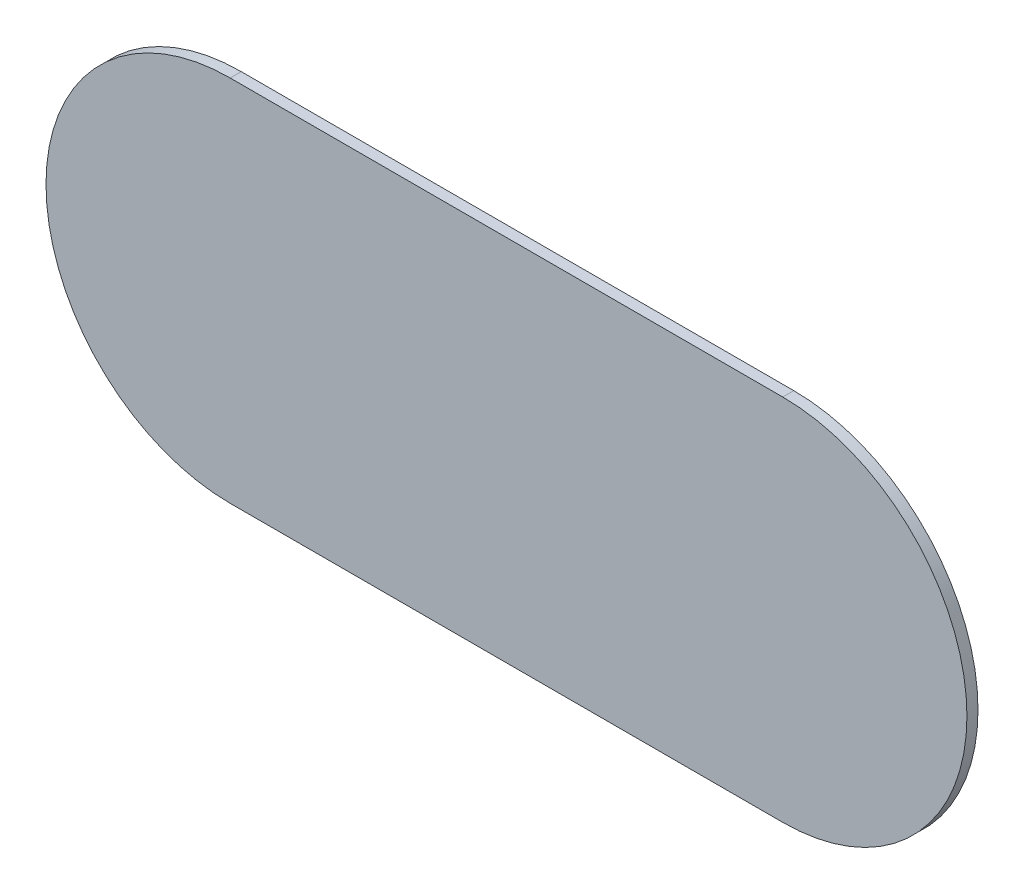
ISO-10303-21;
HEADER;
FILE_DESCRIPTION(('STEP AP214'),'2;1');
FILE_NAME('part.step','',(''),(''),'','','');
FILE_SCHEMA(('AUTOMOTIVE_DESIGN { 1 0 10303 214 1 1 1 1 }'));
ENDSEC;
DATA;
#1=APPLICATION_CONTEXT('core data for automotive mechanical design processes');
#2=APPLICATION_PROTOCOL_DEFINITION('international standard','automotive_design',2000,#1);
#3=PRODUCT_CONTEXT('',#1,'mechanical');
#4=PRODUCT('Part','Part','',(#3));
#5=PRODUCT_RELATED_PRODUCT_CATEGORY('part','',(#4));
#6=PRODUCT_DEFINITION_FORMATION('','',#4);
#7=PRODUCT_DEFINITION_CONTEXT('part definition',#1,'design');
#8=PRODUCT_DEFINITION('design','',#6,#7);
#9=PRODUCT_DEFINITION_SHAPE('','',#8);
#10=(LENGTH_UNIT() NAMED_UNIT(*) SI_UNIT(.MILLI.,.METRE.));
#11=(NAMED_UNIT(*) PLANE_ANGLE_UNIT() SI_UNIT($,.RADIAN.));
#12=(NAMED_UNIT(*) SI_UNIT($,.STERADIAN.) SOLID_ANGLE_UNIT());
#13=UNCERTAINTY_MEASURE_WITH_UNIT(LENGTH_MEASURE(1.E-05),#10,'distance_accuracy_value','');
#14=(GEOMETRIC_REPRESENTATION_CONTEXT(3) GLOBAL_UNCERTAINTY_ASSIGNED_CONTEXT((#13)) GLOBAL_UNIT_ASSIGNED_CONTEXT((#10,
#11,#12)) REPRESENTATION_CONTEXT('',''));
#15=CARTESIAN_POINT('',(0.,0.,0.));
#16=DIRECTION('',(0.,0.,1.));
#17=DIRECTION('',(1.,0.,0.));
#18=AXIS2_PLACEMENT_3D('',#15,#16,#17);
#19=CARTESIAN_POINT('',(70.9921762036265,4.55564847077135,1.5));
#20=DIRECTION('',(0.,0.,-1.));
#21=DIRECTION('',(-1.,0.,0.));
#22=AXIS2_PLACEMENT_3D('',#19,#20,#21);
#23=CYLINDRICAL_SURFACE('',#22,25.);
#24=CARTESIAN_POINT('',(70.9921762036265,4.55564847077135,0.));
#25=DIRECTION('',(0.,0.,1.));
#26=DIRECTION('',(1.,0.,0.));
#27=AXIS2_PLACEMENT_3D('',#24,#25,#26);
#28=CIRCLE('',#27,25.);
#29=CARTESIAN_POINT('',(70.9921762036265,29.5556484707713,0.));
#30=VERTEX_POINT('',#29);
#31=CARTESIAN_POINT('',(70.9921762036265,-20.4443515292286,0.));
#32=VERTEX_POINT('',#31);
#33=EDGE_CURVE('E96',#30,#32,#28,.T.);
#34=ORIENTED_EDGE('',*,*,#33,.T.);
#35=DIRECTION('',(0.,0.,-1.));
#36=VECTOR('',#35,1.);
#37=CARTESIAN_POINT('',(70.9921762036265,-20.4443515292286,1.5));
#38=LINE('',#37,#36);
#39=CARTESIAN_POINT('',(70.9921762036265,-20.4443515292286,1.5));
#40=VERTEX_POINT('',#39);
#41=EDGE_CURVE('E11',#40,#32,#38,.T.);
#42=ORIENTED_EDGE('',*,*,#41,.F.);
#43=CARTESIAN_POINT('',(70.9921762036265,4.55564847077135,1.5));
#44=DIRECTION('',(0.,0.,1.));
#45=DIRECTION('',(1.,0.,0.));
#46=AXIS2_PLACEMENT_3D('',#43,#44,#45);
#47=CIRCLE('',#46,25.);
#48=CARTESIAN_POINT('',(70.9921762036265,29.5556484707713,1.5));
#49=VERTEX_POINT('',#48);
#50=EDGE_CURVE('E84',#49,#40,#47,.T.);
#51=ORIENTED_EDGE('',*,*,#50,.F.);
#52=DIRECTION('',(0.,0.,-1.));
#53=VECTOR('',#52,1.);
#54=CARTESIAN_POINT('',(70.9921762036265,29.5556484707713,1.5));
#55=LINE('',#54,#53);
#56=EDGE_CURVE('E92',#49,#30,#55,.T.);
#57=ORIENTED_EDGE('',*,*,#56,.T.);
#58=EDGE_LOOP('',(#34,#42,#51,#57));
#59=FACE_BOUND('',#58,.T.);
#60=ADVANCED_FACE('F33',(#59),#23,.T.);
#61=CARTESIAN_POINT('',(70.9921762036265,-20.4443515292286,1.5));
#62=DIRECTION('',(0.,1.,0.));
#63=DIRECTION('',(0.,0.,1.));
#64=AXIS2_PLACEMENT_3D('',#61,#62,#63);
#65=PLANE('',#64);
#66=DIRECTION('',(1.,0.,0.));
#67=VECTOR('',#66,1.);
#68=CARTESIAN_POINT('',(70.9921762036265,-20.4443515292286,0.));
#69=LINE('',#68,#67);
#70=CARTESIAN_POINT('',(145.992176203626,-20.4443515292286,0.));
#71=VERTEX_POINT('',#70);
#72=EDGE_CURVE('E88',#32,#71,#69,.T.);
#73=ORIENTED_EDGE('',*,*,#72,.T.);
#74=DIRECTION('',(0.,0.,-1.));
#75=VECTOR('',#74,1.);
#76=CARTESIAN_POINT('',(145.992176203626,-20.4443515292286,1.5));
#77=LINE('',#76,#75);
#78=CARTESIAN_POINT('',(145.992176203626,-20.4443515292286,1.5));
#79=VERTEX_POINT('',#78);
#80=EDGE_CURVE('E41',#79,#71,#77,.T.);
#81=ORIENTED_EDGE('',*,*,#80,.F.);
#82=DIRECTION('',(1.,0.,0.));
#83=VECTOR('',#82,1.);
#84=CARTESIAN_POINT('',(70.9921762036265,-20.4443515292286,1.5));
#85=LINE('',#84,#83);
#86=EDGE_CURVE('E79',#40,#79,#85,.T.);
#87=ORIENTED_EDGE('',*,*,#86,.F.);
#88=ORIENTED_EDGE('',*,*,#41,.T.);
#89=EDGE_LOOP('',(#73,#81,#87,#88));
#90=FACE_BOUND('',#89,.T.);
#91=ADVANCED_FACE('F87',(#90),#65,.F.);
#92=CARTESIAN_POINT('',(145.992176203626,4.55564847077136,1.5));
#93=DIRECTION('',(0.,0.,-1.));
#94=DIRECTION('',(-1.,0.,0.));
#95=AXIS2_PLACEMENT_3D('',#92,#93,#94);
#96=CYLINDRICAL_SURFACE('',#95,25.);
#97=CARTESIAN_POINT('',(145.992176203626,4.55564847077136,0.));
#98=DIRECTION('',(0.,0.,1.));
#99=DIRECTION('',(1.,0.,0.));
#100=AXIS2_PLACEMENT_3D('',#97,#98,#99);
#101=CIRCLE('',#100,25.);
#102=CARTESIAN_POINT('',(145.992176203626,29.5556484707713,0.));
#103=VERTEX_POINT('',#102);
#104=EDGE_CURVE('E66',#71,#103,#101,.T.);
#105=ORIENTED_EDGE('',*,*,#104,.T.);
#106=DIRECTION('',(0.,0.,-1.));
#107=VECTOR('',#106,1.);
#108=CARTESIAN_POINT('',(145.992176203626,29.5556484707713,1.5));
#109=LINE('',#108,#107);
#110=CARTESIAN_POINT('',(145.992176203626,29.5556484707713,1.5));
#111=VERTEX_POINT('',#110);
#112=EDGE_CURVE('E89',#111,#103,#109,.T.);
#113=ORIENTED_EDGE('',*,*,#112,.F.);
#114=CARTESIAN_POINT('',(145.992176203626,4.55564847077136,1.5));
#115=DIRECTION('',(0.,0.,1.));
#116=DIRECTION('',(1.,0.,0.));
#117=AXIS2_PLACEMENT_3D('',#114,#115,#116);
#118=CIRCLE('',#117,25.);
#119=EDGE_CURVE('E82',#79,#111,#118,.T.);
#120=ORIENTED_EDGE('',*,*,#119,.F.);
#121=ORIENTED_EDGE('',*,*,#80,.T.);
#122=EDGE_LOOP('',(#105,#113,#120,#121));
#123=FACE_BOUND('',#122,.T.);
#124=ADVANCED_FACE('F90',(#123),#96,.T.);
#125=CARTESIAN_POINT('',(70.9921762036265,29.5556484707713,1.5));
#126=DIRECTION('',(0.,-1.,0.));
#127=DIRECTION('',(0.,0.,-1.));
#128=AXIS2_PLACEMENT_3D('',#125,#126,#127);
#129=PLANE('',#128);
#130=DIRECTION('',(-1.,0.,0.));
#131=VECTOR('',#130,1.);
#132=CARTESIAN_POINT('',(70.9921762036265,29.5556484707713,0.));
#133=LINE('',#132,#131);
#134=EDGE_CURVE('E72',#103,#30,#133,.T.);
#135=ORIENTED_EDGE('',*,*,#134,.T.);
#136=ORIENTED_EDGE('',*,*,#56,.F.);
#137=DIRECTION('',(-1.,0.,0.));
#138=VECTOR('',#137,1.);
#139=CARTESIAN_POINT('',(70.9921762036265,29.5556484707713,1.5));
#140=LINE('',#139,#138);
#141=EDGE_CURVE('E49',#111,#49,#140,.T.);
#142=ORIENTED_EDGE('',*,*,#141,.F.);
#143=ORIENTED_EDGE('',*,*,#112,.T.);
#144=EDGE_LOOP('',(#135,#136,#142,#143));
#145=FACE_BOUND('',#144,.T.);
#146=ADVANCED_FACE('F103',(#145),#129,.F.);
#147=CARTESIAN_POINT('',(70.9921762036265,4.55564847077135,1.5));
#148=DIRECTION('',(0.,0.,1.));
#149=DIRECTION('',(1.,0.,0.));
#150=AXIS2_PLACEMENT_3D('',#147,#148,#149);
#151=PLANE('',#150);
#152=ORIENTED_EDGE('',*,*,#50,.T.);
#153=ORIENTED_EDGE('',*,*,#86,.T.);
#154=ORIENTED_EDGE('',*,*,#119,.T.);
#155=ORIENTED_EDGE('',*,*,#141,.T.);
#156=EDGE_LOOP('',(#152,#153,#154,#155));
#157=FACE_BOUND('',#156,.T.);
#158=ADVANCED_FACE('F80',(#157),#151,.T.);
#159=CARTESIAN_POINT('',(70.9921762036265,4.55564847077135,0.));
#160=DIRECTION('',(0.,0.,1.));
#161=DIRECTION('',(1.,0.,0.));
#162=AXIS2_PLACEMENT_3D('',#159,#160,#161);
#163=PLANE('',#162);
#164=ORIENTED_EDGE('',*,*,#33,.F.);
#165=ORIENTED_EDGE('',*,*,#134,.F.);
#166=ORIENTED_EDGE('',*,*,#104,.F.);
#167=ORIENTED_EDGE('',*,*,#72,.F.);
#168=EDGE_LOOP('',(#164,#165,#166,#167));
#169=FACE_BOUND('',#168,.T.);
#170=ADVANCED_FACE('F106',(#169),#163,.F.);
#171=CLOSED_SHELL('',(#60,#91,#124,#146,#158,#170));
#172=MANIFOLD_SOLID_BREP('B2',#171);
#173=ADVANCED_BREP_SHAPE_REPRESENTATION('',(#18,#172),#14);
#174=SHAPE_DEFINITION_REPRESENTATION(#9,#173);
ENDSEC;
END-ISO-10303-21;
